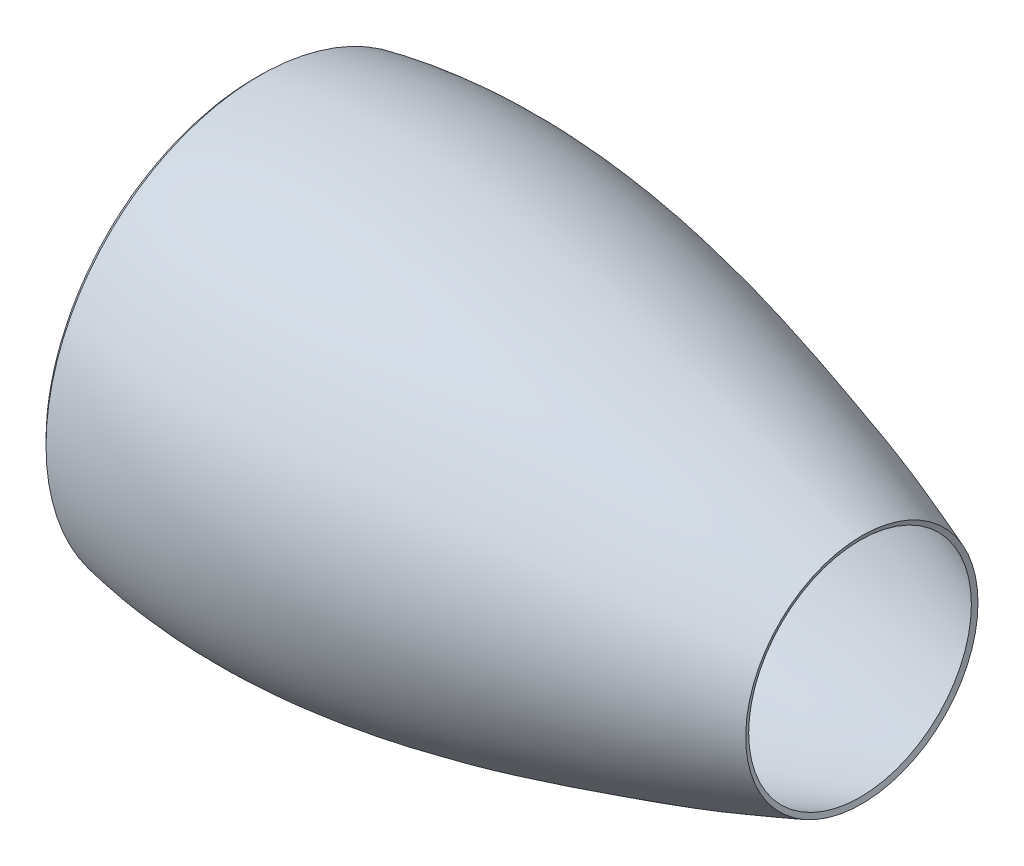
ISO-10303-21;
HEADER;
FILE_DESCRIPTION(('STEP AP214'),'2;1');
FILE_NAME('part.step','',(''),(''),'','','');
FILE_SCHEMA(('AUTOMOTIVE_DESIGN { 1 0 10303 214 1 1 1 1 }'));
ENDSEC;
DATA;
#1=APPLICATION_CONTEXT('core data for automotive mechanical design processes');
#2=APPLICATION_PROTOCOL_DEFINITION('international standard','automotive_design',2000,#1);
#3=PRODUCT_CONTEXT('',#1,'mechanical');
#4=PRODUCT('Part','Part','',(#3));
#5=PRODUCT_RELATED_PRODUCT_CATEGORY('part','',(#4));
#6=PRODUCT_DEFINITION_FORMATION('','',#4);
#7=PRODUCT_DEFINITION_CONTEXT('part definition',#1,'design');
#8=PRODUCT_DEFINITION('design','',#6,#7);
#9=PRODUCT_DEFINITION_SHAPE('','',#8);
#10=(LENGTH_UNIT() NAMED_UNIT(*) SI_UNIT(.MILLI.,.METRE.));
#11=(NAMED_UNIT(*) PLANE_ANGLE_UNIT() SI_UNIT($,.RADIAN.));
#12=(NAMED_UNIT(*) SI_UNIT($,.STERADIAN.) SOLID_ANGLE_UNIT());
#13=UNCERTAINTY_MEASURE_WITH_UNIT(LENGTH_MEASURE(1.E-05),#10,'distance_accuracy_value','');
#14=(GEOMETRIC_REPRESENTATION_CONTEXT(3) GLOBAL_UNCERTAINTY_ASSIGNED_CONTEXT((#13)) GLOBAL_UNIT_ASSIGNED_CONTEXT((#10,
#11,#12)) REPRESENTATION_CONTEXT('',''));
#15=CARTESIAN_POINT('',(0.,0.,0.));
#16=DIRECTION('',(0.,0.,1.));
#17=DIRECTION('',(1.,0.,0.));
#18=AXIS2_PLACEMENT_3D('',#15,#16,#17);
#19=CARTESIAN_POINT('',(65.4256832085789,0.,0.));
#20=DIRECTION('',(-1.,0.,0.));
#21=DIRECTION('',(0.,0.,1.));
#22=AXIS2_PLACEMENT_3D('',#19,#20,#21);
#23=PLANE('',#22);
#24=CARTESIAN_POINT('',(65.4256832085789,0.,0.));
#25=DIRECTION('',(1.,0.,0.));
#26=DIRECTION('',(0.,0.,-1.));
#27=AXIS2_PLACEMENT_3D('',#24,#25,#26);
#28=CIRCLE('',#27,185.);
#29=CARTESIAN_POINT('',(65.4256832085789,0.,-185.));
#30=VERTEX_POINT('',#29);
#31=EDGE_CURVE('E52',#30,#30,#28,.T.);
#32=ORIENTED_EDGE('',*,*,#31,.F.);
#33=EDGE_LOOP('',(#32));
#34=FACE_BOUND('',#33,.T.);
#35=CARTESIAN_POINT('',(65.4256832085789,0.,0.));
#36=DIRECTION('',(1.,0.,0.));
#37=DIRECTION('',(0.,0.,-1.));
#38=AXIS2_PLACEMENT_3D('',#35,#36,#37);
#39=CIRCLE('',#38,190.);
#40=CARTESIAN_POINT('',(65.4256832085789,0.,-190.));
#41=VERTEX_POINT('',#40);
#42=EDGE_CURVE('E118',#41,#41,#39,.T.);
#43=ORIENTED_EDGE('',*,*,#42,.T.);
#44=EDGE_LOOP('',(#43));
#45=FACE_BOUND('',#44,.T.);
#46=ADVANCED_FACE('F34',(#34,#45),#23,.F.);
#47=CARTESIAN_POINT('',(580.,0.,0.));
#48=DIRECTION('',(1.,0.,0.));
#49=DIRECTION('',(0.,0.,-1.));
#50=AXIS2_PLACEMENT_3D('',#47,#48,#49);
#51=CONICAL_SURFACE('',#50,108.,1.21087660621223);
#52=CARTESIAN_POINT('',(581.760995494442,0.,0.));
#53=DIRECTION('',(1.,0.,0.));
#54=DIRECTION('',(0.,1.,0.));
#55=AXIS2_PLACEMENT_3D('',#52,#53,#54);
#56=CIRCLE('',#55,112.679625505161);
#57=CARTESIAN_POINT('',(581.760995494442,112.679625505161,0.));
#58=VERTEX_POINT('',#57);
#59=EDGE_CURVE('E10',#58,#58,#56,.T.);
#60=ORIENTED_EDGE('',*,*,#59,.T.);
#61=EDGE_LOOP('',(#60));
#62=FACE_BOUND('',#61,.T.);
#63=CARTESIAN_POINT('',(580.,0.,0.));
#64=DIRECTION('',(1.,0.,0.));
#65=DIRECTION('',(0.,0.,-1.));
#66=AXIS2_PLACEMENT_3D('',#63,#64,#65);
#67=CIRCLE('',#66,108.);
#68=CARTESIAN_POINT('',(580.,0.,-108.));
#69=VERTEX_POINT('',#68);
#70=EDGE_CURVE('E132',#69,#69,#67,.T.);
#71=ORIENTED_EDGE('',*,*,#70,.F.);
#72=EDGE_LOOP('',(#71));
#73=FACE_BOUND('',#72,.T.);
#74=ADVANCED_FACE('F145',(#62,#73),#51,.F.);
#75=CARTESIAN_POINT('',(580.,108.,0.));
#76=CARTESIAN_POINT('',(506.646826015992,135.603621004791,0.));
#77=CARTESIAN_POINT('',(447.299518909973,152.468770907529,0.));
#78=CARTESIAN_POINT('',(162.717006581838,235.034574592374,0.));
#79=CARTESIAN_POINT('',(-2.5979241376299,202.113522118347,0.));
#80=CARTESIAN_POINT('',(-5.19584827525981,201.596167778444,0.));
#81=CARTESIAN_POINT('',(-7.79377241288971,201.078813438541,0.));
#82=B_SPLINE_CURVE_WITH_KNOTS('',3,(#75,#76,#77,#78,#79,#80,#81),.UNSPECIFIED.,.F.,.F.,(4,1,2,
4),(0.,0.373665288277874,1.,1.01),.UNSPECIFIED.);
#83=CARTESIAN_POINT('',(0.,0.,0.));
#84=DIRECTION('',(1.,0.,0.));
#85=AXIS1_PLACEMENT('',#83,#84);
#86=SURFACE_OF_REVOLUTION('',#82,#85);
#87=OFFSET_SURFACE('',#86,-5.,.F.);
#88=CARTESIAN_POINT('',(-2.32633416992485,0.,0.));
#89=DIRECTION('',(1.,0.,0.));
#90=DIRECTION('',(0.,0.,-1.));
#91=AXIS2_PLACEMENT_3D('',#88,#89,#90);
#92=CIRCLE('',#91,207.265786292999);
#93=CARTESIAN_POINT('',(-2.32633416992485,0.,-207.265786292999));
#94=VERTEX_POINT('',#93);
#95=EDGE_CURVE('E41',#94,#94,#92,.T.);
#96=ORIENTED_EDGE('',*,*,#95,.T.);
#97=EDGE_LOOP('',(#96));
#98=FACE_BOUND('',#97,.T.);
#99=ORIENTED_EDGE('',*,*,#59,.F.);
#100=EDGE_LOOP('',(#99));
#101=FACE_BOUND('',#100,.T.);
#102=ADVANCED_FACE('F71',(#98,#101),#87,.F.);
#103=CARTESIAN_POINT('',(1.02210425481612,203.552572036359,0.));
#104=CARTESIAN_POINT('',(0.51105212740806,203.091724247304,0.));
#105=CARTESIAN_POINT('',(-12.7615457793984,191.122989411223,0.));
#106=CARTESIAN_POINT('',(0.70604260894858,179.38461181749,0.));
#107=CARTESIAN_POINT('',(1.41208521789716,178.769223634979,0.));
#108=B_SPLINE_CURVE_WITH_KNOTS('',2,(#103,#104,#105,#106,#107),.UNSPECIFIED.,.F.,.F.,(3,1,1,3),
(-0.0400462558566436,0.,1.,1.05532579055496),.UNSPECIFIED.);
#109=CARTESIAN_POINT('',(0.,0.,0.));
#110=DIRECTION('',(1.,0.,0.));
#111=AXIS1_PLACEMENT('',#109,#110);
#112=SURFACE_OF_REVOLUTION('',#108,#111);
#113=OFFSET_SURFACE('',#112,-5.,.F.);
#114=CARTESIAN_POINT('',(-1.87317781411624,0.,0.));
#115=DIRECTION('',(1.,0.,0.));
#116=DIRECTION('',(0.,0.,-1.));
#117=AXIS2_PLACEMENT_3D('',#114,#115,#116);
#118=CIRCLE('',#117,175.);
#119=CARTESIAN_POINT('',(-1.87317781411624,0.,-175.));
#120=VERTEX_POINT('',#119);
#121=EDGE_CURVE('E46',#120,#120,#118,.T.);
#122=ORIENTED_EDGE('',*,*,#121,.T.);
#123=EDGE_LOOP('',(#122));
#124=FACE_BOUND('',#123,.T.);
#125=ORIENTED_EDGE('',*,*,#95,.F.);
#126=EDGE_LOOP('',(#125));
#127=FACE_BOUND('',#126,.T.);
#128=ADVANCED_FACE('F72',(#124,#127),#113,.F.);
#129=CARTESIAN_POINT('',(0.,0.,0.));
#130=DIRECTION('',(1.,0.,0.));
#131=DIRECTION('',(0.,0.,-1.));
#132=AXIS2_PLACEMENT_3D('',#129,#130,#131);
#133=CYLINDRICAL_SURFACE('',#132,175.);
#134=CARTESIAN_POINT('',(26.4788897675936,0.,0.));
#135=DIRECTION('',(1.,0.,0.));
#136=DIRECTION('',(0.,0.,-1.));
#137=AXIS2_PLACEMENT_3D('',#134,#135,#136);
#138=CIRCLE('',#137,175.);
#139=CARTESIAN_POINT('',(26.4788897675936,0.,-175.));
#140=VERTEX_POINT('',#139);
#141=EDGE_CURVE('E55',#140,#140,#138,.T.);
#142=ORIENTED_EDGE('',*,*,#141,.T.);
#143=EDGE_LOOP('',(#142));
#144=FACE_BOUND('',#143,.T.);
#145=ORIENTED_EDGE('',*,*,#121,.F.);
#146=EDGE_LOOP('',(#145));
#147=FACE_BOUND('',#146,.T.);
#148=ADVANCED_FACE('F75',(#144,#147),#133,.F.);
#149=CARTESIAN_POINT('',(27.719835794644,0.,0.));
#150=DIRECTION('',(1.,0.,0.));
#151=DIRECTION('',(0.,0.,-1.));
#152=AXIS2_PLACEMENT_3D('',#149,#150,#151);
#153=CONICAL_SURFACE('',#152,175.804467465247,0.575157740974555);
#154=CARTESIAN_POINT('',(41.9045729761724,0.,0.));
#155=DIRECTION('',(1.,0.,0.));
#156=DIRECTION('',(0.,0.,-1.));
#157=AXIS2_PLACEMENT_3D('',#154,#155,#156);
#158=CIRCLE('',#157,185.);
#159=CARTESIAN_POINT('',(41.9045729761724,0.,-185.));
#160=VERTEX_POINT('',#159);
#161=EDGE_CURVE('E50',#160,#160,#158,.T.);
#162=ORIENTED_EDGE('',*,*,#161,.T.);
#163=EDGE_LOOP('',(#162));
#164=FACE_BOUND('',#163,.T.);
#165=ORIENTED_EDGE('',*,*,#141,.F.);
#166=EDGE_LOOP('',(#165));
#167=FACE_BOUND('',#166,.T.);
#168=ADVANCED_FACE('F81',(#164,#167),#153,.F.);
#169=CARTESIAN_POINT('',(0.,0.,0.));
#170=DIRECTION('',(1.,0.,0.));
#171=DIRECTION('',(0.,0.,-1.));
#172=AXIS2_PLACEMENT_3D('',#169,#170,#171);
#173=CYLINDRICAL_SURFACE('',#172,185.);
#174=ORIENTED_EDGE('',*,*,#31,.T.);
#175=EDGE_LOOP('',(#174));
#176=FACE_BOUND('',#175,.T.);
#177=ORIENTED_EDGE('',*,*,#161,.F.);
#178=EDGE_LOOP('',(#177));
#179=FACE_BOUND('',#178,.T.);
#180=ADVANCED_FACE('F85',(#176,#179),#173,.F.);
#181=CARTESIAN_POINT('',(580.,108.,0.));
#182=CARTESIAN_POINT('',(506.646826015992,135.603621004791,0.));
#183=CARTESIAN_POINT('',(447.299518909973,152.468770907529,0.));
#184=CARTESIAN_POINT('',(162.717006581838,235.034574592374,0.));
#185=CARTESIAN_POINT('',(0.,202.630876458249,0.));
#186=B_SPLINE_CURVE_WITH_KNOTS('',3,(#181,#182,#183,#184,#185),.UNSPECIFIED.,.F.,.F.,(4,1,4),
(0.,0.373665288277874,1.),.UNSPECIFIED.);
#187=CARTESIAN_POINT('',(0.,0.,0.));
#188=DIRECTION('',(1.,0.,0.));
#189=AXIS1_PLACEMENT('',#187,#188);
#190=SURFACE_OF_REVOLUTION('',#186,#189);
#191=CARTESIAN_POINT('',(0.,0.,0.));
#192=DIRECTION('',(1.,0.,0.));
#193=DIRECTION('',(0.,0.,-1.));
#194=AXIS2_PLACEMENT_3D('',#191,#192,#193);
#195=CIRCLE('',#194,202.630876458249);
#196=CARTESIAN_POINT('',(0.,0.,-202.630876458249));
#197=VERTEX_POINT('',#196);
#198=EDGE_CURVE('E37',#197,#197,#195,.T.);
#199=ORIENTED_EDGE('',*,*,#198,.F.);
#200=EDGE_LOOP('',(#199));
#201=FACE_BOUND('',#200,.T.);
#202=ORIENTED_EDGE('',*,*,#70,.T.);
#203=EDGE_LOOP('',(#202));
#204=FACE_BOUND('',#203,.T.);
#205=ADVANCED_FACE('F89',(#201,#204),#190,.T.);
#206=CARTESIAN_POINT('',(0.,202.630876458249,0.));
#207=CARTESIAN_POINT('',(-12.7615457793984,191.122989411223,0.));
#208=CARTESIAN_POINT('',(0.,180.,0.));
#209=B_SPLINE_CURVE_WITH_KNOTS('',2,(#206,#207,#208),.UNSPECIFIED.,.F.,.F.,(3,3),(0.,1.),.UNSPECIFIED.);
#210=CARTESIAN_POINT('',(0.,0.,0.));
#211=DIRECTION('',(1.,0.,0.));
#212=AXIS1_PLACEMENT('',#210,#211);
#213=SURFACE_OF_REVOLUTION('',#209,#212);
#214=CARTESIAN_POINT('',(0.,0.,0.));
#215=DIRECTION('',(1.,0.,0.));
#216=DIRECTION('',(0.,0.,-1.));
#217=AXIS2_PLACEMENT_3D('',#214,#215,#216);
#218=CIRCLE('',#217,180.);
#219=CARTESIAN_POINT('',(0.,0.,-180.));
#220=VERTEX_POINT('',#219);
#221=EDGE_CURVE('E130',#220,#220,#218,.T.);
#222=ORIENTED_EDGE('',*,*,#221,.F.);
#223=EDGE_LOOP('',(#222));
#224=FACE_BOUND('',#223,.T.);
#225=ORIENTED_EDGE('',*,*,#198,.T.);
#226=EDGE_LOOP('',(#225));
#227=FACE_BOUND('',#226,.T.);
#228=ADVANCED_FACE('F102',(#224,#227),#213,.T.);
#229=CARTESIAN_POINT('',(0.,0.,0.));
#230=DIRECTION('',(1.,0.,0.));
#231=DIRECTION('',(0.,0.,-1.));
#232=AXIS2_PLACEMENT_3D('',#229,#230,#231);
#233=CYLINDRICAL_SURFACE('',#232,180.);
#234=CARTESIAN_POINT('',(25.,0.,0.));
#235=DIRECTION('',(1.,0.,0.));
#236=DIRECTION('',(0.,0.,-1.));
#237=AXIS2_PLACEMENT_3D('',#234,#235,#236);
#238=CIRCLE('',#237,180.);
#239=CARTESIAN_POINT('',(25.,0.,-180.));
#240=VERTEX_POINT('',#239);
#241=EDGE_CURVE('E124',#240,#240,#238,.T.);
#242=ORIENTED_EDGE('',*,*,#241,.F.);
#243=EDGE_LOOP('',(#242));
#244=FACE_BOUND('',#243,.T.);
#245=ORIENTED_EDGE('',*,*,#221,.T.);
#246=EDGE_LOOP('',(#245));
#247=FACE_BOUND('',#246,.T.);
#248=ADVANCED_FACE('F98',(#244,#247),#233,.T.);
#249=CARTESIAN_POINT('',(25.,0.,0.));
#250=DIRECTION('',(1.,0.,0.));
#251=DIRECTION('',(0.,0.,-1.));
#252=AXIS2_PLACEMENT_3D('',#249,#250,#251);
#253=CONICAL_SURFACE('',#252,180.,0.575157740974555);
#254=CARTESIAN_POINT('',(40.4256832085789,0.,0.));
#255=DIRECTION('',(1.,0.,0.));
#256=DIRECTION('',(0.,0.,-1.));
#257=AXIS2_PLACEMENT_3D('',#254,#255,#256);
#258=CIRCLE('',#257,190.);
#259=CARTESIAN_POINT('',(40.4256832085789,0.,-190.));
#260=VERTEX_POINT('',#259);
#261=EDGE_CURVE('E125',#260,#260,#258,.T.);
#262=ORIENTED_EDGE('',*,*,#261,.F.);
#263=EDGE_LOOP('',(#262));
#264=FACE_BOUND('',#263,.T.);
#265=ORIENTED_EDGE('',*,*,#241,.T.);
#266=EDGE_LOOP('',(#265));
#267=FACE_BOUND('',#266,.T.);
#268=ADVANCED_FACE('F94',(#264,#267),#253,.T.);
#269=CARTESIAN_POINT('',(0.,0.,0.));
#270=DIRECTION('',(1.,0.,0.));
#271=DIRECTION('',(0.,0.,-1.));
#272=AXIS2_PLACEMENT_3D('',#269,#270,#271);
#273=CYLINDRICAL_SURFACE('',#272,190.);
#274=ORIENTED_EDGE('',*,*,#42,.F.);
#275=EDGE_LOOP('',(#274));
#276=FACE_BOUND('',#275,.T.);
#277=ORIENTED_EDGE('',*,*,#261,.T.);
#278=EDGE_LOOP('',(#277));
#279=FACE_BOUND('',#278,.T.);
#280=ADVANCED_FACE('F91',(#276,#279),#273,.T.);
#281=CLOSED_SHELL('',(#46,#74,#102,#128,#148,#168,#180,#205,#228,#248,#268,#280));
#282=MANIFOLD_SOLID_BREP('B2',#281);
#283=ADVANCED_BREP_SHAPE_REPRESENTATION('',(#18,#282),#14);
#284=SHAPE_DEFINITION_REPRESENTATION(#9,#283);
ENDSEC;
END-ISO-10303-21;
